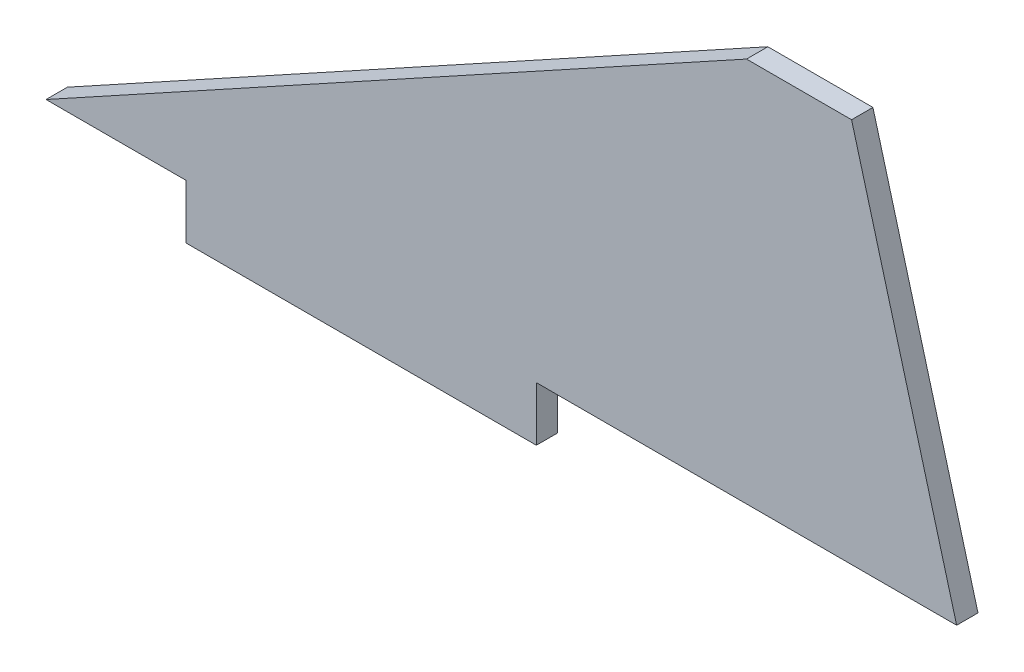
ISO-10303-21;
HEADER;
FILE_DESCRIPTION(('STEP AP214'),'2;1');
FILE_NAME('part.step','',(''),(''),'','','');
FILE_SCHEMA(('AUTOMOTIVE_DESIGN { 1 0 10303 214 1 1 1 1 }'));
ENDSEC;
DATA;
#1=APPLICATION_CONTEXT('core data for automotive mechanical design processes');
#2=APPLICATION_PROTOCOL_DEFINITION('international standard','automotive_design',2000,#1);
#3=PRODUCT_CONTEXT('',#1,'mechanical');
#4=PRODUCT('Part','Part','',(#3));
#5=PRODUCT_RELATED_PRODUCT_CATEGORY('part','',(#4));
#6=PRODUCT_DEFINITION_FORMATION('','',#4);
#7=PRODUCT_DEFINITION_CONTEXT('part definition',#1,'design');
#8=PRODUCT_DEFINITION('design','',#6,#7);
#9=PRODUCT_DEFINITION_SHAPE('','',#8);
#10=(LENGTH_UNIT() NAMED_UNIT(*) SI_UNIT(.MILLI.,.METRE.));
#11=(NAMED_UNIT(*) PLANE_ANGLE_UNIT() SI_UNIT($,.RADIAN.));
#12=(NAMED_UNIT(*) SI_UNIT($,.STERADIAN.) SOLID_ANGLE_UNIT());
#13=UNCERTAINTY_MEASURE_WITH_UNIT(LENGTH_MEASURE(1.E-05),#10,'distance_accuracy_value','');
#14=(GEOMETRIC_REPRESENTATION_CONTEXT(3) GLOBAL_UNCERTAINTY_ASSIGNED_CONTEXT((#13)) GLOBAL_UNIT_ASSIGNED_CONTEXT((#10,
#11,#12)) REPRESENTATION_CONTEXT('',''));
#15=CARTESIAN_POINT('',(0.,0.,0.));
#16=DIRECTION('',(0.,0.,1.));
#17=DIRECTION('',(1.,0.,0.));
#18=AXIS2_PLACEMENT_3D('',#15,#16,#17);
#19=CARTESIAN_POINT('',(100.,55.,3.048));
#20=DIRECTION('',(0.481918749772156,-0.876215908676647,0.));
#21=DIRECTION('',(0.876215908676647,0.481918749772156,0.));
#22=AXIS2_PLACEMENT_3D('',#19,#20,#21);
#23=PLANE('',#22);
#24=DIRECTION('',(-0.876215908676647,-0.481918749772156,0.));
#25=VECTOR('',#24,1.);
#26=CARTESIAN_POINT('',(100.,55.,0.));
#27=LINE('',#26,#25);
#28=CARTESIAN_POINT('',(100.,55.,0.));
#29=VERTEX_POINT('',#28);
#30=CARTESIAN_POINT('',(0.,0.,0.));
#31=VERTEX_POINT('',#30);
#32=EDGE_CURVE('E130',#29,#31,#27,.T.);
#33=ORIENTED_EDGE('',*,*,#32,.T.);
#34=DIRECTION('',(0.,0.,-1.));
#35=VECTOR('',#34,1.);
#36=CARTESIAN_POINT('',(0.,0.,3.048));
#37=LINE('',#36,#35);
#38=CARTESIAN_POINT('',(0.,0.,3.048));
#39=VERTEX_POINT('',#38);
#40=EDGE_CURVE('E11',#39,#31,#37,.T.);
#41=ORIENTED_EDGE('',*,*,#40,.F.);
#42=DIRECTION('',(-0.876215908676647,-0.481918749772156,0.));
#43=VECTOR('',#42,1.);
#44=CARTESIAN_POINT('',(100.,55.,3.048));
#45=LINE('',#44,#43);
#46=CARTESIAN_POINT('',(100.,55.,3.048));
#47=VERTEX_POINT('',#46);
#48=EDGE_CURVE('E144',#47,#39,#45,.T.);
#49=ORIENTED_EDGE('',*,*,#48,.F.);
#50=DIRECTION('',(0.,0.,-1.));
#51=VECTOR('',#50,1.);
#52=CARTESIAN_POINT('',(100.,55.,3.048));
#53=LINE('',#52,#51);
#54=EDGE_CURVE('E126',#47,#29,#53,.T.);
#55=ORIENTED_EDGE('',*,*,#54,.T.);
#56=EDGE_LOOP('',(#33,#41,#49,#55));
#57=FACE_BOUND('',#56,.T.);
#58=ADVANCED_FACE('F34',(#57),#23,.F.);
#59=CARTESIAN_POINT('',(0.,0.,3.048));
#60=DIRECTION('',(0.,1.,0.));
#61=DIRECTION('',(0.,0.,1.));
#62=AXIS2_PLACEMENT_3D('',#59,#60,#61);
#63=PLANE('',#62);
#64=DIRECTION('',(1.,0.,0.));
#65=VECTOR('',#64,1.);
#66=CARTESIAN_POINT('',(0.,0.,0.));
#67=LINE('',#66,#65);
#68=CARTESIAN_POINT('',(20.,0.,0.));
#69=VERTEX_POINT('',#68);
#70=EDGE_CURVE('E133',#31,#69,#67,.T.);
#71=ORIENTED_EDGE('',*,*,#70,.T.);
#72=DIRECTION('',(0.,0.,-1.));
#73=VECTOR('',#72,1.);
#74=CARTESIAN_POINT('',(20.,0.,3.048));
#75=LINE('',#74,#73);
#76=CARTESIAN_POINT('',(20.,0.,3.048));
#77=VERTEX_POINT('',#76);
#78=EDGE_CURVE('E42',#77,#69,#75,.T.);
#79=ORIENTED_EDGE('',*,*,#78,.F.);
#80=DIRECTION('',(1.,0.,0.));
#81=VECTOR('',#80,1.);
#82=CARTESIAN_POINT('',(0.,0.,3.048));
#83=LINE('',#82,#81);
#84=EDGE_CURVE('E93',#39,#77,#83,.T.);
#85=ORIENTED_EDGE('',*,*,#84,.F.);
#86=ORIENTED_EDGE('',*,*,#40,.T.);
#87=EDGE_LOOP('',(#71,#79,#85,#86));
#88=FACE_BOUND('',#87,.T.);
#89=ADVANCED_FACE('F179',(#88),#63,.F.);
#90=CARTESIAN_POINT('',(20.,0.,3.048));
#91=DIRECTION('',(1.,0.,0.));
#92=DIRECTION('',(0.,0.,-1.));
#93=AXIS2_PLACEMENT_3D('',#90,#91,#92);
#94=PLANE('',#93);
#95=DIRECTION('',(0.,-1.,0.));
#96=VECTOR('',#95,1.);
#97=CARTESIAN_POINT('',(20.,0.,0.));
#98=LINE('',#97,#96);
#99=CARTESIAN_POINT('',(20.,-7.747,0.));
#100=VERTEX_POINT('',#99);
#101=EDGE_CURVE('E135',#69,#100,#98,.T.);
#102=ORIENTED_EDGE('',*,*,#101,.T.);
#103=DIRECTION('',(0.,0.,-1.));
#104=VECTOR('',#103,1.);
#105=CARTESIAN_POINT('',(20.,-7.747,3.048));
#106=LINE('',#105,#104);
#107=CARTESIAN_POINT('',(20.,-7.747,3.048));
#108=VERTEX_POINT('',#107);
#109=EDGE_CURVE('E151',#108,#100,#106,.T.);
#110=ORIENTED_EDGE('',*,*,#109,.F.);
#111=DIRECTION('',(0.,-1.,0.));
#112=VECTOR('',#111,1.);
#113=CARTESIAN_POINT('',(20.,0.,3.048));
#114=LINE('',#113,#112);
#115=EDGE_CURVE('E159',#77,#108,#114,.T.);
#116=ORIENTED_EDGE('',*,*,#115,.F.);
#117=ORIENTED_EDGE('',*,*,#78,.T.);
#118=EDGE_LOOP('',(#102,#110,#116,#117));
#119=FACE_BOUND('',#118,.T.);
#120=ADVANCED_FACE('F157',(#119),#94,.F.);
#121=CARTESIAN_POINT('',(20.,-7.747,3.048));
#122=DIRECTION('',(0.,1.,0.));
#123=DIRECTION('',(0.,0.,1.));
#124=AXIS2_PLACEMENT_3D('',#121,#122,#123);
#125=PLANE('',#124);
#126=DIRECTION('',(1.,0.,0.));
#127=VECTOR('',#126,1.);
#128=CARTESIAN_POINT('',(20.,-7.747,0.));
#129=LINE('',#128,#127);
#130=CARTESIAN_POINT('',(70.,-7.747,0.));
#131=VERTEX_POINT('',#130);
#132=EDGE_CURVE('E137',#100,#131,#129,.T.);
#133=ORIENTED_EDGE('',*,*,#132,.T.);
#134=DIRECTION('',(0.,0.,-1.));
#135=VECTOR('',#134,1.);
#136=CARTESIAN_POINT('',(70.,-7.747,3.048));
#137=LINE('',#136,#135);
#138=CARTESIAN_POINT('',(70.,-7.747,3.048));
#139=VERTEX_POINT('',#138);
#140=EDGE_CURVE('E148',#139,#131,#137,.T.);
#141=ORIENTED_EDGE('',*,*,#140,.F.);
#142=DIRECTION('',(1.,0.,0.));
#143=VECTOR('',#142,1.);
#144=CARTESIAN_POINT('',(20.,-7.747,3.048));
#145=LINE('',#144,#143);
#146=EDGE_CURVE('E171',#108,#139,#145,.T.);
#147=ORIENTED_EDGE('',*,*,#146,.F.);
#148=ORIENTED_EDGE('',*,*,#109,.T.);
#149=EDGE_LOOP('',(#133,#141,#147,#148));
#150=FACE_BOUND('',#149,.T.);
#151=ADVANCED_FACE('F167',(#150),#125,.F.);
#152=CARTESIAN_POINT('',(70.,-7.747,3.048));
#153=DIRECTION('',(-1.,0.,0.));
#154=DIRECTION('',(0.,0.,1.));
#155=AXIS2_PLACEMENT_3D('',#152,#153,#154);
#156=PLANE('',#155);
#157=DIRECTION('',(0.,1.,0.));
#158=VECTOR('',#157,1.);
#159=CARTESIAN_POINT('',(70.,-7.747,0.));
#160=LINE('',#159,#158);
#161=CARTESIAN_POINT('',(70.,0.,0.));
#162=VERTEX_POINT('',#161);
#163=EDGE_CURVE('E139',#131,#162,#160,.T.);
#164=ORIENTED_EDGE('',*,*,#163,.T.);
#165=DIRECTION('',(0.,0.,-1.));
#166=VECTOR('',#165,1.);
#167=CARTESIAN_POINT('',(70.,0.,3.048));
#168=LINE('',#167,#166);
#169=CARTESIAN_POINT('',(70.,0.,3.048));
#170=VERTEX_POINT('',#169);
#171=EDGE_CURVE('E121',#170,#162,#168,.T.);
#172=ORIENTED_EDGE('',*,*,#171,.F.);
#173=DIRECTION('',(0.,1.,0.));
#174=VECTOR('',#173,1.);
#175=CARTESIAN_POINT('',(70.,-7.747,3.048));
#176=LINE('',#175,#174);
#177=EDGE_CURVE('E112',#139,#170,#176,.T.);
#178=ORIENTED_EDGE('',*,*,#177,.F.);
#179=ORIENTED_EDGE('',*,*,#140,.T.);
#180=EDGE_LOOP('',(#164,#172,#178,#179));
#181=FACE_BOUND('',#180,.T.);
#182=ADVANCED_FACE('F170',(#181),#156,.F.);
#183=CARTESIAN_POINT('',(70.,0.,3.048));
#184=DIRECTION('',(0.,1.,0.));
#185=DIRECTION('',(-1.,0.,0.));
#186=AXIS2_PLACEMENT_3D('',#183,#184,#185);
#187=PLANE('',#186);
#188=DIRECTION('',(1.,0.,0.));
#189=VECTOR('',#188,1.);
#190=CARTESIAN_POINT('',(70.,0.,0.));
#191=LINE('',#190,#189);
#192=CARTESIAN_POINT('',(130.,0.,0.));
#193=VERTEX_POINT('',#192);
#194=EDGE_CURVE('E120',#162,#193,#191,.T.);
#195=ORIENTED_EDGE('',*,*,#194,.T.);
#196=DIRECTION('',(0.,0.,-1.));
#197=VECTOR('',#196,1.);
#198=CARTESIAN_POINT('',(130.,0.,3.048));
#199=LINE('',#198,#197);
#200=CARTESIAN_POINT('',(130.,0.,3.048));
#201=VERTEX_POINT('',#200);
#202=EDGE_CURVE('E117',#201,#193,#199,.T.);
#203=ORIENTED_EDGE('',*,*,#202,.F.);
#204=DIRECTION('',(1.,0.,0.));
#205=VECTOR('',#204,1.);
#206=CARTESIAN_POINT('',(70.,0.,3.048));
#207=LINE('',#206,#205);
#208=EDGE_CURVE('E106',#170,#201,#207,.T.);
#209=ORIENTED_EDGE('',*,*,#208,.F.);
#210=ORIENTED_EDGE('',*,*,#171,.T.);
#211=EDGE_LOOP('',(#195,#203,#209,#210));
#212=FACE_BOUND('',#211,.T.);
#213=ADVANCED_FACE('F118',(#212),#187,.F.);
#214=CARTESIAN_POINT('',(130.,0.,3.048));
#215=DIRECTION('',(-0.964763821237732,-0.263117405792109,0.));
#216=DIRECTION('',(0.263117405792109,-0.964763821237732,0.));
#217=AXIS2_PLACEMENT_3D('',#214,#215,#216);
#218=PLANE('',#217);
#219=DIRECTION('',(-0.263117405792109,0.964763821237732,0.));
#220=VECTOR('',#219,1.);
#221=CARTESIAN_POINT('',(130.,0.,0.));
#222=LINE('',#221,#220);
#223=CARTESIAN_POINT('',(115.,55.,0.));
#224=VERTEX_POINT('',#223);
#225=EDGE_CURVE('E79',#193,#224,#222,.T.);
#226=ORIENTED_EDGE('',*,*,#225,.T.);
#227=DIRECTION('',(0.,0.,-1.));
#228=VECTOR('',#227,1.);
#229=CARTESIAN_POINT('',(115.,55.,3.048));
#230=LINE('',#229,#228);
#231=CARTESIAN_POINT('',(115.,55.,3.048));
#232=VERTEX_POINT('',#231);
#233=EDGE_CURVE('E122',#232,#224,#230,.T.);
#234=ORIENTED_EDGE('',*,*,#233,.F.);
#235=DIRECTION('',(-0.263117405792109,0.964763821237732,0.));
#236=VECTOR('',#235,1.);
#237=CARTESIAN_POINT('',(130.,0.,3.048));
#238=LINE('',#237,#236);
#239=EDGE_CURVE('E110',#201,#232,#238,.T.);
#240=ORIENTED_EDGE('',*,*,#239,.F.);
#241=ORIENTED_EDGE('',*,*,#202,.T.);
#242=EDGE_LOOP('',(#226,#234,#240,#241));
#243=FACE_BOUND('',#242,.T.);
#244=ADVANCED_FACE('F124',(#243),#218,.F.);
#245=CARTESIAN_POINT('',(115.,55.,3.048));
#246=DIRECTION('',(0.,-1.,0.));
#247=DIRECTION('',(1.,0.,0.));
#248=AXIS2_PLACEMENT_3D('',#245,#246,#247);
#249=PLANE('',#248);
#250=DIRECTION('',(-1.,0.,0.));
#251=VECTOR('',#250,1.);
#252=CARTESIAN_POINT('',(115.,55.,0.));
#253=LINE('',#252,#251);
#254=EDGE_CURVE('E85',#224,#29,#253,.T.);
#255=ORIENTED_EDGE('',*,*,#254,.T.);
#256=ORIENTED_EDGE('',*,*,#54,.F.);
#257=DIRECTION('',(-1.,0.,0.));
#258=VECTOR('',#257,1.);
#259=CARTESIAN_POINT('',(115.,55.,3.048));
#260=LINE('',#259,#258);
#261=EDGE_CURVE('E50',#232,#47,#260,.T.);
#262=ORIENTED_EDGE('',*,*,#261,.F.);
#263=ORIENTED_EDGE('',*,*,#233,.T.);
#264=EDGE_LOOP('',(#255,#256,#262,#263));
#265=FACE_BOUND('',#264,.T.);
#266=ADVANCED_FACE('F195',(#265),#249,.F.);
#267=CARTESIAN_POINT('',(0.,0.,3.048));
#268=DIRECTION('',(0.,0.,-1.));
#269=DIRECTION('',(-1.,0.,0.));
#270=AXIS2_PLACEMENT_3D('',#267,#268,#269);
#271=PLANE('',#270);
#272=ORIENTED_EDGE('',*,*,#48,.T.);
#273=ORIENTED_EDGE('',*,*,#84,.T.);
#274=ORIENTED_EDGE('',*,*,#115,.T.);
#275=ORIENTED_EDGE('',*,*,#146,.T.);
#276=ORIENTED_EDGE('',*,*,#177,.T.);
#277=ORIENTED_EDGE('',*,*,#208,.T.);
#278=ORIENTED_EDGE('',*,*,#239,.T.);
#279=ORIENTED_EDGE('',*,*,#261,.T.);
#280=EDGE_LOOP('',(#272,#273,#274,#275,#276,#277,#278,#279));
#281=FACE_BOUND('',#280,.T.);
#282=ADVANCED_FACE('F108',(#281),#271,.F.);
#283=CARTESIAN_POINT('',(0.,0.,0.));
#284=DIRECTION('',(0.,0.,-1.));
#285=DIRECTION('',(-1.,0.,0.));
#286=AXIS2_PLACEMENT_3D('',#283,#284,#285);
#287=PLANE('',#286);
#288=ORIENTED_EDGE('',*,*,#32,.F.);
#289=ORIENTED_EDGE('',*,*,#254,.F.);
#290=ORIENTED_EDGE('',*,*,#225,.F.);
#291=ORIENTED_EDGE('',*,*,#194,.F.);
#292=ORIENTED_EDGE('',*,*,#163,.F.);
#293=ORIENTED_EDGE('',*,*,#132,.F.);
#294=ORIENTED_EDGE('',*,*,#101,.F.);
#295=ORIENTED_EDGE('',*,*,#70,.F.);
#296=EDGE_LOOP('',(#288,#289,#290,#291,#292,#293,#294,#295));
#297=FACE_BOUND('',#296,.T.);
#298=ADVANCED_FACE('F163',(#297),#287,.T.);
#299=CLOSED_SHELL('',(#58,#89,#120,#151,#182,#213,#244,#266,#282,#298));
#300=MANIFOLD_SOLID_BREP('B2',#299);
#301=ADVANCED_BREP_SHAPE_REPRESENTATION('',(#18,#300),#14);
#302=SHAPE_DEFINITION_REPRESENTATION(#9,#301);
ENDSEC;
END-ISO-10303-21;
